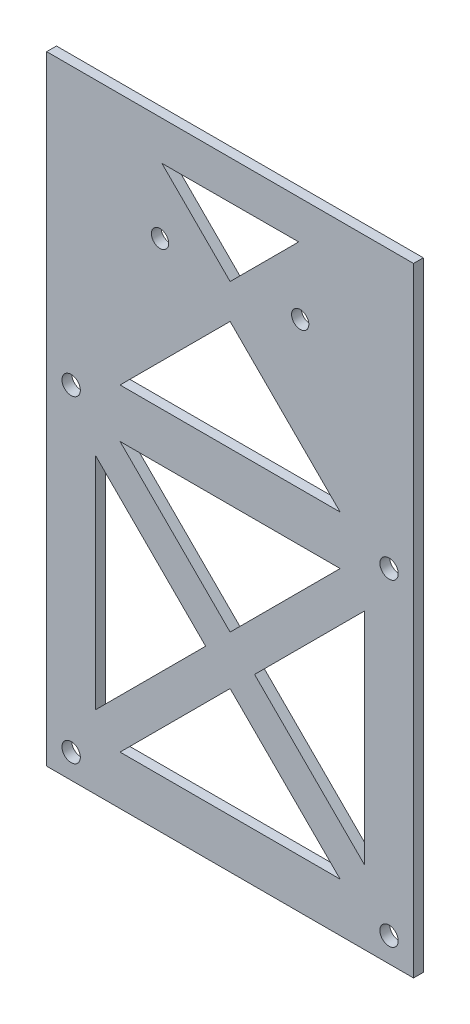
ISO-10303-21;
HEADER;
FILE_DESCRIPTION(('STEP AP214'),'2;1');
FILE_NAME('part.step','',(''),(''),'','','');
FILE_SCHEMA(('AUTOMOTIVE_DESIGN { 1 0 10303 214 1 1 1 1 }'));
ENDSEC;
DATA;
#1=APPLICATION_CONTEXT('core data for automotive mechanical design processes');
#2=APPLICATION_PROTOCOL_DEFINITION('international standard','automotive_design',2000,#1);
#3=PRODUCT_CONTEXT('',#1,'mechanical');
#4=PRODUCT('Part','Part','',(#3));
#5=PRODUCT_RELATED_PRODUCT_CATEGORY('part','',(#4));
#6=PRODUCT_DEFINITION_FORMATION('','',#4);
#7=PRODUCT_DEFINITION_CONTEXT('part definition',#1,'design');
#8=PRODUCT_DEFINITION('design','',#6,#7);
#9=PRODUCT_DEFINITION_SHAPE('','',#8);
#10=(LENGTH_UNIT() NAMED_UNIT(*) SI_UNIT(.MILLI.,.METRE.));
#11=(NAMED_UNIT(*) PLANE_ANGLE_UNIT() SI_UNIT($,.RADIAN.));
#12=(NAMED_UNIT(*) SI_UNIT($,.STERADIAN.) SOLID_ANGLE_UNIT());
#13=UNCERTAINTY_MEASURE_WITH_UNIT(LENGTH_MEASURE(1.E-05),#10,'distance_accuracy_value','');
#14=(GEOMETRIC_REPRESENTATION_CONTEXT(3) GLOBAL_UNCERTAINTY_ASSIGNED_CONTEXT((#13)) GLOBAL_UNIT_ASSIGNED_CONTEXT((#10,
#11,#12)) REPRESENTATION_CONTEXT('',''));
#15=CARTESIAN_POINT('',(0.,0.,0.));
#16=DIRECTION('',(0.,0.,1.));
#17=DIRECTION('',(1.,0.,0.));
#18=AXIS2_PLACEMENT_3D('',#15,#16,#17);
#19=CARTESIAN_POINT('',(0.,0.,2.));
#20=DIRECTION('',(0.,0.,-1.));
#21=DIRECTION('',(-1.,0.,0.));
#22=AXIS2_PLACEMENT_3D('',#19,#20,#21);
#23=PLANE('',#22);
#24=DIRECTION('',(-0.707106781186547,-0.707106781186548,0.));
#25=VECTOR('',#24,1.);
#26=CARTESIAN_POINT('',(3.76378278876638E-13,-232.048366883126,2.));
#27=LINE('',#26,#25);
#28=CARTESIAN_POINT('',(3.76378278876638E-13,-232.048366883126,2.));
#29=VERTEX_POINT('',#28);
#30=CARTESIAN_POINT('',(-22.4999999999999,-254.548366883126,2.));
#31=VERTEX_POINT('',#30);
#32=EDGE_CURVE('E749',#29,#31,#27,.T.);
#33=ORIENTED_EDGE('',*,*,#32,.F.);
#34=DIRECTION('',(-0.707106781186556,0.707106781186539,0.));
#35=VECTOR('',#34,1.);
#36=CARTESIAN_POINT('',(3.76378278876638E-13,-232.048366883126,2.));
#37=LINE('',#36,#35);
#38=CARTESIAN_POINT('',(22.5000000000012,-254.548366883126,2.));
#39=VERTEX_POINT('',#38);
#40=EDGE_CURVE('E757',#39,#29,#37,.T.);
#41=ORIENTED_EDGE('',*,*,#40,.F.);
#42=DIRECTION('',(1.,0.,0.));
#43=VECTOR('',#42,1.);
#44=CARTESIAN_POINT('',(-22.4999999999999,-254.548366883126,2.));
#45=LINE('',#44,#43);
#46=EDGE_CURVE('E752',#31,#39,#45,.T.);
#47=ORIENTED_EDGE('',*,*,#46,.F.);
#48=EDGE_LOOP('',(#33,#41,#47));
#49=FACE_BOUND('',#48,.T.);
#50=CARTESIAN_POINT('',(-32.4999999999997,-194.548366883126,2.));
#51=DIRECTION('',(0.,0.,1.));
#52=DIRECTION('',(1.,0.,0.));
#53=AXIS2_PLACEMENT_3D('',#50,#51,#52);
#54=CIRCLE('',#53,1.87499999999998);
#55=CARTESIAN_POINT('',(-30.6249999999998,-194.548366883126,2.));
#56=VERTEX_POINT('',#55);
#57=EDGE_CURVE('E232',#56,#56,#54,.T.);
#58=ORIENTED_EDGE('',*,*,#57,.F.);
#59=EDGE_LOOP('',(#58));
#60=FACE_BOUND('',#59,.T.);
#61=DIRECTION('',(-0.999997214116541,-0.00236045740423836,0.));
#62=VECTOR('',#61,1.);
#63=CARTESIAN_POINT('',(-13.9582791202752,-146.020087762851,2.));
#64=LINE('',#63,#62);
#65=CARTESIAN_POINT('',(14.0243310636869,-145.954035819439,2.));
#66=VERTEX_POINT('',#65);
#67=CARTESIAN_POINT('',(-13.9582791202752,-146.020087762851,2.));
#68=VERTEX_POINT('',#67);
#69=EDGE_CURVE('E247',#66,#68,#64,.T.);
#70=ORIENTED_EDGE('',*,*,#69,.F.);
#71=DIRECTION('',(0.707106781186545,0.70710678118655,0.));
#72=VECTOR('',#71,1.);
#73=CARTESIAN_POINT('',(14.0243310636869,-145.954035819439,2.));
#74=LINE('',#73,#72);
#75=CARTESIAN_POINT('',(0.,-159.978366883126,2.));
#76=VERTEX_POINT('',#75);
#77=EDGE_CURVE('E257',#76,#66,#74,.T.);
#78=ORIENTED_EDGE('',*,*,#77,.F.);
#79=DIRECTION('',(0.707106781186547,-0.707106781186547,0.));
#80=VECTOR('',#79,1.);
#81=CARTESIAN_POINT('',(0.,-159.978366883126,2.));
#82=LINE('',#81,#80);
#83=EDGE_CURVE('E252',#68,#76,#82,.T.);
#84=ORIENTED_EDGE('',*,*,#83,.F.);
#85=EDGE_LOOP('',(#70,#78,#84));
#86=FACE_BOUND('',#85,.T.);
#87=DIRECTION('',(0.707106781186547,0.707106781186548,0.));
#88=VECTOR('',#87,1.);
#89=CARTESIAN_POINT('',(3.25643952203386E-13,-222.048366883126,2.));
#90=LINE('',#89,#88);
#91=CARTESIAN_POINT('',(3.25643952203386E-13,-222.048366883126,2.));
#92=VERTEX_POINT('',#91);
#93=CARTESIAN_POINT('',(22.5,-199.548366883126,2.));
#94=VERTEX_POINT('',#93);
#95=EDGE_CURVE('E265',#92,#94,#90,.T.);
#96=ORIENTED_EDGE('',*,*,#95,.F.);
#97=DIRECTION('',(0.707106781186556,-0.707106781186539,0.));
#98=VECTOR('',#97,1.);
#99=CARTESIAN_POINT('',(-22.4999999999999,-199.548366883126,2.));
#100=LINE('',#99,#98);
#101=CARTESIAN_POINT('',(-22.4999999999999,-199.548366883126,2.));
#102=VERTEX_POINT('',#101);
#103=EDGE_CURVE('E277',#102,#92,#100,.T.);
#104=ORIENTED_EDGE('',*,*,#103,.F.);
#105=DIRECTION('',(-1.,0.,0.));
#106=VECTOR('',#105,1.);
#107=CARTESIAN_POINT('',(-22.4999999999999,-199.548366883126,2.));
#108=LINE('',#107,#106);
#109=EDGE_CURVE('E270',#94,#102,#108,.T.);
#110=ORIENTED_EDGE('',*,*,#109,.F.);
#111=EDGE_LOOP('',(#96,#104,#110));
#112=FACE_BOUND('',#111,.T.);
#113=CARTESIAN_POINT('',(14.3295057189679,-159.529421113488,2.));
#114=DIRECTION('',(0.,0.,1.));
#115=DIRECTION('',(1.,0.,0.));
#116=AXIS2_PLACEMENT_3D('',#113,#114,#115);
#117=CIRCLE('',#116,1.765);
#118=CARTESIAN_POINT('',(16.0945057189679,-159.529421113488,2.));
#119=VERTEX_POINT('',#118);
#120=EDGE_CURVE('E285',#119,#119,#117,.T.);
#121=ORIENTED_EDGE('',*,*,#120,.F.);
#122=EDGE_LOOP('',(#121));
#123=FACE_BOUND('',#122,.T.);
#124=CARTESIAN_POINT('',(-14.3295057189679,-159.529421113488,2.));
#125=DIRECTION('',(0.,0.,1.));
#126=DIRECTION('',(-1.,0.,0.));
#127=AXIS2_PLACEMENT_3D('',#124,#125,#126);
#128=CIRCLE('',#127,1.765);
#129=CARTESIAN_POINT('',(-16.0945057189679,-159.529421113488,2.));
#130=VERTEX_POINT('',#129);
#131=EDGE_CURVE('E505',#130,#130,#128,.T.);
#132=ORIENTED_EDGE('',*,*,#131,.F.);
#133=EDGE_LOOP('',(#132));
#134=FACE_BOUND('',#133,.T.);
#135=DIRECTION('',(0.,-1.,0.));
#136=VECTOR('',#135,1.);
#137=CARTESIAN_POINT('',(-37.4999999999999,-264.548366883126,2.));
#138=LINE('',#137,#136);
#139=CARTESIAN_POINT('',(-37.4999999999999,-138.029421113488,2.));
#140=VERTEX_POINT('',#139);
#141=CARTESIAN_POINT('',(-37.4999999999999,-264.548366883126,2.));
#142=VERTEX_POINT('',#141);
#143=EDGE_CURVE('E485',#140,#142,#138,.T.);
#144=ORIENTED_EDGE('',*,*,#143,.T.);
#145=DIRECTION('',(1.,0.,0.));
#146=VECTOR('',#145,1.);
#147=CARTESIAN_POINT('',(-37.4999999999999,-264.548366883126,2.));
#148=LINE('',#147,#146);
#149=CARTESIAN_POINT('',(37.5,-264.548366883126,2.));
#150=VERTEX_POINT('',#149);
#151=EDGE_CURVE('E500',#142,#150,#148,.T.);
#152=ORIENTED_EDGE('',*,*,#151,.T.);
#153=DIRECTION('',(0.,1.,0.));
#154=VECTOR('',#153,1.);
#155=CARTESIAN_POINT('',(37.5,-264.548366883126,2.));
#156=LINE('',#155,#154);
#157=CARTESIAN_POINT('',(37.5,-138.029421113488,2.));
#158=VERTEX_POINT('',#157);
#159=EDGE_CURVE('E479',#150,#158,#156,.T.);
#160=ORIENTED_EDGE('',*,*,#159,.T.);
#161=DIRECTION('',(-1.,0.,0.));
#162=VECTOR('',#161,1.);
#163=CARTESIAN_POINT('',(-37.4999999999999,-138.029421113488,2.));
#164=LINE('',#163,#162);
#165=EDGE_CURVE('E492',#158,#140,#164,.T.);
#166=ORIENTED_EDGE('',*,*,#165,.T.);
#167=EDGE_LOOP('',(#144,#152,#160,#166));
#168=FACE_BOUND('',#167,.T.);
#169=CARTESIAN_POINT('',(32.5,-259.548366883126,2.));
#170=DIRECTION('',(0.,0.,1.));
#171=DIRECTION('',(1.,0.,0.));
#172=AXIS2_PLACEMENT_3D('',#169,#170,#171);
#173=CIRCLE('',#172,1.87499999999998);
#174=CARTESIAN_POINT('',(34.375,-259.548366883126,2.));
#175=VERTEX_POINT('',#174);
#176=EDGE_CURVE('E297',#175,#175,#173,.T.);
#177=ORIENTED_EDGE('',*,*,#176,.F.);
#178=EDGE_LOOP('',(#177));
#179=FACE_BOUND('',#178,.T.);
#180=DIRECTION('',(0.707106781186547,0.707106781186548,0.));
#181=VECTOR('',#180,1.);
#182=CARTESIAN_POINT('',(-27.4999999999999,-249.548366883126,2.));
#183=LINE('',#182,#181);
#184=CARTESIAN_POINT('',(-27.4999999999999,-249.548366883126,2.));
#185=VERTEX_POINT('',#184);
#186=CARTESIAN_POINT('',(-4.99999999999968,-227.048366883126,2.));
#187=VERTEX_POINT('',#186);
#188=EDGE_CURVE('E312',#185,#187,#183,.T.);
#189=ORIENTED_EDGE('',*,*,#188,.F.);
#190=DIRECTION('',(0.,-1.,0.));
#191=VECTOR('',#190,1.);
#192=CARTESIAN_POINT('',(-27.4999999999999,-204.548366883126,2.));
#193=LINE('',#192,#191);
#194=CARTESIAN_POINT('',(-27.4999999999999,-204.548366883126,2.));
#195=VERTEX_POINT('',#194);
#196=EDGE_CURVE('E324',#195,#185,#193,.T.);
#197=ORIENTED_EDGE('',*,*,#196,.F.);
#198=DIRECTION('',(-0.707106781186556,0.707106781186539,0.));
#199=VECTOR('',#198,1.);
#200=CARTESIAN_POINT('',(-27.4999999999999,-204.548366883126,2.));
#201=LINE('',#200,#199);
#202=EDGE_CURVE('E317',#187,#195,#201,.T.);
#203=ORIENTED_EDGE('',*,*,#202,.F.);
#204=EDGE_LOOP('',(#189,#197,#203));
#205=FACE_BOUND('',#204,.T.);
#206=DIRECTION('',(-0.707106781186547,-0.707106781186548,0.));
#207=VECTOR('',#206,1.);
#208=CARTESIAN_POINT('',(27.5,-204.548366883126,2.));
#209=LINE('',#208,#207);
#210=CARTESIAN_POINT('',(27.5,-204.548366883126,2.));
#211=VERTEX_POINT('',#210);
#212=CARTESIAN_POINT('',(5.00000000000038,-227.048366883126,2.));
#213=VERTEX_POINT('',#212);
#214=EDGE_CURVE('E331',#211,#213,#209,.T.);
#215=ORIENTED_EDGE('',*,*,#214,.F.);
#216=DIRECTION('',(0.,1.,0.));
#217=VECTOR('',#216,1.);
#218=CARTESIAN_POINT('',(27.5,-249.548366883125,2.));
#219=LINE('',#218,#217);
#220=CARTESIAN_POINT('',(27.5,-249.548366883125,2.));
#221=VERTEX_POINT('',#220);
#222=EDGE_CURVE('E343',#221,#211,#219,.T.);
#223=ORIENTED_EDGE('',*,*,#222,.F.);
#224=DIRECTION('',(0.707106781186556,-0.707106781186539,0.));
#225=VECTOR('',#224,1.);
#226=CARTESIAN_POINT('',(5.00000000000038,-227.048366883126,2.));
#227=LINE('',#226,#225);
#228=EDGE_CURVE('E336',#213,#221,#227,.T.);
#229=ORIENTED_EDGE('',*,*,#228,.F.);
#230=EDGE_LOOP('',(#215,#223,#229));
#231=FACE_BOUND('',#230,.T.);
#232=CARTESIAN_POINT('',(-32.5000000000001,-259.548366883126,2.));
#233=DIRECTION('',(0.,0.,1.));
#234=DIRECTION('',(1.,0.,0.));
#235=AXIS2_PLACEMENT_3D('',#232,#233,#234);
#236=CIRCLE('',#235,1.87499999999998);
#237=CARTESIAN_POINT('',(-30.6250000000001,-259.548366883126,2.));
#238=VERTEX_POINT('',#237);
#239=EDGE_CURVE('E408',#238,#238,#236,.T.);
#240=ORIENTED_EDGE('',*,*,#239,.F.);
#241=EDGE_LOOP('',(#240));
#242=FACE_BOUND('',#241,.T.);
#243=CARTESIAN_POINT('',(32.5000000000004,-194.548366883126,2.));
#244=DIRECTION('',(0.,0.,1.));
#245=DIRECTION('',(1.,0.,0.));
#246=AXIS2_PLACEMENT_3D('',#243,#244,#245);
#247=CIRCLE('',#246,1.87499999999998);
#248=CARTESIAN_POINT('',(34.3750000000004,-194.548366883126,2.));
#249=VERTEX_POINT('',#248);
#250=EDGE_CURVE('E220',#249,#249,#247,.T.);
#251=ORIENTED_EDGE('',*,*,#250,.F.);
#252=EDGE_LOOP('',(#251));
#253=FACE_BOUND('',#252,.T.);
#254=DIRECTION('',(-0.707106781186548,-0.707106781186547,0.));
#255=VECTOR('',#254,1.);
#256=CARTESIAN_POINT('',(0.,-167.048366883126,2.));
#257=LINE('',#256,#255);
#258=CARTESIAN_POINT('',(0.,-167.048366883126,2.));
#259=VERTEX_POINT('',#258);
#260=CARTESIAN_POINT('',(-22.4999999999999,-189.548366883126,2.));
#261=VERTEX_POINT('',#260);
#262=EDGE_CURVE('E187',#259,#261,#257,.T.);
#263=ORIENTED_EDGE('',*,*,#262,.F.);
#264=DIRECTION('',(-0.707106781186549,0.707106781186546,0.));
#265=VECTOR('',#264,1.);
#266=CARTESIAN_POINT('',(0.,-167.048366883126,2.));
#267=LINE('',#266,#265);
#268=CARTESIAN_POINT('',(22.5000000000001,-189.548366883126,2.));
#269=VERTEX_POINT('',#268);
#270=EDGE_CURVE('E205',#269,#259,#267,.T.);
#271=ORIENTED_EDGE('',*,*,#270,.F.);
#272=DIRECTION('',(1.,0.,0.));
#273=VECTOR('',#272,1.);
#274=CARTESIAN_POINT('',(-22.4999999999999,-189.548366883126,2.));
#275=LINE('',#274,#273);
#276=EDGE_CURVE('E196',#261,#269,#275,.T.);
#277=ORIENTED_EDGE('',*,*,#276,.F.);
#278=EDGE_LOOP('',(#263,#271,#277));
#279=FACE_BOUND('',#278,.T.);
#280=ADVANCED_FACE('F38',(#49,#60,#86,#112,#123,#134,#168,#179,#205,#231,#242,#253,#279),#23,.F.);
#281=CARTESIAN_POINT('',(0.,0.,0.));
#282=DIRECTION('',(0.,0.,-1.));
#283=DIRECTION('',(-1.,0.,0.));
#284=AXIS2_PLACEMENT_3D('',#281,#282,#283);
#285=PLANE('',#284);
#286=DIRECTION('',(-0.707106781186556,0.707106781186539,0.));
#287=VECTOR('',#286,1.);
#288=CARTESIAN_POINT('',(3.76378278876638E-13,-232.048366883126,0.));
#289=LINE('',#288,#287);
#290=CARTESIAN_POINT('',(22.5000000000012,-254.548366883126,0.));
#291=VERTEX_POINT('',#290);
#292=CARTESIAN_POINT('',(3.88578058618805E-13,-232.048366883126,0.));
#293=VERTEX_POINT('',#292);
#294=EDGE_CURVE('E753',#291,#293,#289,.T.);
#295=ORIENTED_EDGE('',*,*,#294,.T.);
#296=DIRECTION('',(-0.707106781186547,-0.707106781186548,0.));
#297=VECTOR('',#296,1.);
#298=CARTESIAN_POINT('',(3.76378278876638E-13,-232.048366883126,0.));
#299=LINE('',#298,#297);
#300=CARTESIAN_POINT('',(-22.4999999999999,-254.548366883126,0.));
#301=VERTEX_POINT('',#300);
#302=EDGE_CURVE('E203',#293,#301,#299,.T.);
#303=ORIENTED_EDGE('',*,*,#302,.T.);
#304=DIRECTION('',(1.,0.,0.));
#305=VECTOR('',#304,1.);
#306=CARTESIAN_POINT('',(-22.4999999999999,-254.548366883126,0.));
#307=LINE('',#306,#305);
#308=EDGE_CURVE('E764',#301,#291,#307,.T.);
#309=ORIENTED_EDGE('',*,*,#308,.T.);
#310=EDGE_LOOP('',(#295,#303,#309));
#311=FACE_BOUND('',#310,.T.);
#312=CARTESIAN_POINT('',(-32.4999999999997,-194.548366883126,0.));
#313=DIRECTION('',(0.,0.,1.));
#314=DIRECTION('',(1.,0.,0.));
#315=AXIS2_PLACEMENT_3D('',#312,#313,#314);
#316=CIRCLE('',#315,1.87499999999998);
#317=CARTESIAN_POINT('',(-30.6249999999998,-194.548366883126,0.));
#318=VERTEX_POINT('',#317);
#319=EDGE_CURVE('E226',#318,#318,#316,.T.);
#320=ORIENTED_EDGE('',*,*,#319,.T.);
#321=EDGE_LOOP('',(#320));
#322=FACE_BOUND('',#321,.T.);
#323=DIRECTION('',(0.707106781186545,0.70710678118655,0.));
#324=VECTOR('',#323,1.);
#325=CARTESIAN_POINT('',(14.0243310636869,-145.954035819439,0.));
#326=LINE('',#325,#324);
#327=CARTESIAN_POINT('',(0.,-159.978366883126,0.));
#328=VERTEX_POINT('',#327);
#329=CARTESIAN_POINT('',(14.0243310636869,-145.954035819439,0.));
#330=VERTEX_POINT('',#329);
#331=EDGE_CURVE('E253',#328,#330,#326,.T.);
#332=ORIENTED_EDGE('',*,*,#331,.T.);
#333=DIRECTION('',(-0.999997214116541,-0.00236045740423836,0.));
#334=VECTOR('',#333,1.);
#335=CARTESIAN_POINT('',(-13.9582791202752,-146.020087762851,0.));
#336=LINE('',#335,#334);
#337=CARTESIAN_POINT('',(-13.9582791202752,-146.020087762851,0.));
#338=VERTEX_POINT('',#337);
#339=EDGE_CURVE('E410',#330,#338,#336,.T.);
#340=ORIENTED_EDGE('',*,*,#339,.T.);
#341=DIRECTION('',(0.707106781186547,-0.707106781186547,0.));
#342=VECTOR('',#341,1.);
#343=CARTESIAN_POINT('',(0.,-159.978366883126,0.));
#344=LINE('',#343,#342);
#345=EDGE_CURVE('E414',#338,#328,#344,.T.);
#346=ORIENTED_EDGE('',*,*,#345,.T.);
#347=EDGE_LOOP('',(#332,#340,#346));
#348=FACE_BOUND('',#347,.T.);
#349=DIRECTION('',(0.707106781186556,-0.707106781186539,0.));
#350=VECTOR('',#349,1.);
#351=CARTESIAN_POINT('',(-22.4999999999999,-199.548366883126,0.));
#352=LINE('',#351,#350);
#353=CARTESIAN_POINT('',(-22.4999999999999,-199.548366883126,0.));
#354=VERTEX_POINT('',#353);
#355=CARTESIAN_POINT('',(3.19189119579733E-13,-222.048366883126,0.));
#356=VERTEX_POINT('',#355);
#357=EDGE_CURVE('E271',#354,#356,#352,.T.);
#358=ORIENTED_EDGE('',*,*,#357,.T.);
#359=DIRECTION('',(0.707106781186547,0.707106781186548,0.));
#360=VECTOR('',#359,1.);
#361=CARTESIAN_POINT('',(3.25643952203386E-13,-222.048366883126,0.));
#362=LINE('',#361,#360);
#363=CARTESIAN_POINT('',(22.5,-199.548366883126,0.));
#364=VERTEX_POINT('',#363);
#365=EDGE_CURVE('E361',#356,#364,#362,.T.);
#366=ORIENTED_EDGE('',*,*,#365,.T.);
#367=DIRECTION('',(-1.,0.,0.));
#368=VECTOR('',#367,1.);
#369=CARTESIAN_POINT('',(-22.4999999999999,-199.548366883126,0.));
#370=LINE('',#369,#368);
#371=EDGE_CURVE('E365',#364,#354,#370,.T.);
#372=ORIENTED_EDGE('',*,*,#371,.T.);
#373=EDGE_LOOP('',(#358,#366,#372));
#374=FACE_BOUND('',#373,.T.);
#375=CARTESIAN_POINT('',(14.3295057189679,-159.529421113488,0.));
#376=DIRECTION('',(0.,0.,1.));
#377=DIRECTION('',(1.,0.,0.));
#378=AXIS2_PLACEMENT_3D('',#375,#376,#377);
#379=CIRCLE('',#378,1.765);
#380=CARTESIAN_POINT('',(16.0945057189679,-159.529421113488,0.));
#381=VERTEX_POINT('',#380);
#382=EDGE_CURVE('E292',#381,#381,#379,.T.);
#383=ORIENTED_EDGE('',*,*,#382,.T.);
#384=EDGE_LOOP('',(#383));
#385=FACE_BOUND('',#384,.T.);
#386=CARTESIAN_POINT('',(-14.3295057189679,-159.529421113488,0.));
#387=DIRECTION('',(0.,0.,1.));
#388=DIRECTION('',(-1.,0.,0.));
#389=AXIS2_PLACEMENT_3D('',#386,#387,#388);
#390=CIRCLE('',#389,1.765);
#391=CARTESIAN_POINT('',(-16.0945057189679,-159.529421113488,0.));
#392=VERTEX_POINT('',#391);
#393=EDGE_CURVE('E302',#392,#392,#390,.T.);
#394=ORIENTED_EDGE('',*,*,#393,.T.);
#395=EDGE_LOOP('',(#394));
#396=FACE_BOUND('',#395,.T.);
#397=DIRECTION('',(0.,-1.,0.));
#398=VECTOR('',#397,1.);
#399=CARTESIAN_POINT('',(-37.4999999999999,-264.548366883126,0.));
#400=LINE('',#399,#398);
#401=CARTESIAN_POINT('',(-37.4999999999999,-138.029421113488,0.));
#402=VERTEX_POINT('',#401);
#403=CARTESIAN_POINT('',(-37.4999999999999,-264.548366883126,0.));
#404=VERTEX_POINT('',#403);
#405=EDGE_CURVE('E475',#402,#404,#400,.T.);
#406=ORIENTED_EDGE('',*,*,#405,.F.);
#407=DIRECTION('',(-1.,0.,0.));
#408=VECTOR('',#407,1.);
#409=CARTESIAN_POINT('',(-37.4999999999999,-138.029421113488,0.));
#410=LINE('',#409,#408);
#411=CARTESIAN_POINT('',(37.5,-138.029421113488,0.));
#412=VERTEX_POINT('',#411);
#413=EDGE_CURVE('E483',#412,#402,#410,.T.);
#414=ORIENTED_EDGE('',*,*,#413,.F.);
#415=DIRECTION('',(0.,1.,0.));
#416=VECTOR('',#415,1.);
#417=CARTESIAN_POINT('',(37.5,-264.548366883126,0.));
#418=LINE('',#417,#416);
#419=CARTESIAN_POINT('',(37.5,-264.548366883126,0.));
#420=VERTEX_POINT('',#419);
#421=EDGE_CURVE('E474',#420,#412,#418,.T.);
#422=ORIENTED_EDGE('',*,*,#421,.F.);
#423=DIRECTION('',(1.,0.,0.));
#424=VECTOR('',#423,1.);
#425=CARTESIAN_POINT('',(-37.4999999999999,-264.548366883126,0.));
#426=LINE('',#425,#424);
#427=EDGE_CURVE('E466',#404,#420,#426,.T.);
#428=ORIENTED_EDGE('',*,*,#427,.F.);
#429=EDGE_LOOP('',(#406,#414,#422,#428));
#430=FACE_BOUND('',#429,.T.);
#431=CARTESIAN_POINT('',(32.5,-259.548366883126,0.));
#432=DIRECTION('',(0.,0.,1.));
#433=DIRECTION('',(1.,0.,0.));
#434=AXIS2_PLACEMENT_3D('',#431,#432,#433);
#435=CIRCLE('',#434,1.87499999999998);
#436=CARTESIAN_POINT('',(34.375,-259.548366883126,0.));
#437=VERTEX_POINT('',#436);
#438=EDGE_CURVE('E291',#437,#437,#435,.T.);
#439=ORIENTED_EDGE('',*,*,#438,.T.);
#440=EDGE_LOOP('',(#439));
#441=FACE_BOUND('',#440,.T.);
#442=DIRECTION('',(0.,-1.,0.));
#443=VECTOR('',#442,1.);
#444=CARTESIAN_POINT('',(-27.4999999999999,-204.548366883126,0.));
#445=LINE('',#444,#443);
#446=CARTESIAN_POINT('',(-27.4999999999999,-204.548366883126,0.));
#447=VERTEX_POINT('',#446);
#448=CARTESIAN_POINT('',(-27.4999999999999,-249.548366883126,0.));
#449=VERTEX_POINT('',#448);
#450=EDGE_CURVE('E318',#447,#449,#445,.T.);
#451=ORIENTED_EDGE('',*,*,#450,.T.);
#452=DIRECTION('',(0.707106781186547,0.707106781186548,0.));
#453=VECTOR('',#452,1.);
#454=CARTESIAN_POINT('',(-27.4999999999999,-249.548366883126,0.));
#455=LINE('',#454,#453);
#456=CARTESIAN_POINT('',(-4.99999999999968,-227.048366883126,0.));
#457=VERTEX_POINT('',#456);
#458=EDGE_CURVE('E378',#449,#457,#455,.T.);
#459=ORIENTED_EDGE('',*,*,#458,.T.);
#460=DIRECTION('',(-0.707106781186556,0.707106781186539,0.));
#461=VECTOR('',#460,1.);
#462=CARTESIAN_POINT('',(-27.4999999999999,-204.548366883126,0.));
#463=LINE('',#462,#461);
#464=EDGE_CURVE('E382',#457,#447,#463,.T.);
#465=ORIENTED_EDGE('',*,*,#464,.T.);
#466=EDGE_LOOP('',(#451,#459,#465));
#467=FACE_BOUND('',#466,.T.);
#468=DIRECTION('',(0.,1.,0.));
#469=VECTOR('',#468,1.);
#470=CARTESIAN_POINT('',(27.5,-249.548366883125,0.));
#471=LINE('',#470,#469);
#472=CARTESIAN_POINT('',(27.5,-249.548366883125,0.));
#473=VERTEX_POINT('',#472);
#474=CARTESIAN_POINT('',(27.5,-204.548366883126,0.));
#475=VERTEX_POINT('',#474);
#476=EDGE_CURVE('E337',#473,#475,#471,.T.);
#477=ORIENTED_EDGE('',*,*,#476,.T.);
#478=DIRECTION('',(-0.707106781186547,-0.707106781186548,0.));
#479=VECTOR('',#478,1.);
#480=CARTESIAN_POINT('',(27.5,-204.548366883126,0.));
#481=LINE('',#480,#479);
#482=CARTESIAN_POINT('',(5.00000000000038,-227.048366883126,0.));
#483=VERTEX_POINT('',#482);
#484=EDGE_CURVE('E348',#475,#483,#481,.T.);
#485=ORIENTED_EDGE('',*,*,#484,.T.);
#486=DIRECTION('',(0.707106781186556,-0.707106781186539,0.));
#487=VECTOR('',#486,1.);
#488=CARTESIAN_POINT('',(5.00000000000038,-227.048366883126,0.));
#489=LINE('',#488,#487);
#490=EDGE_CURVE('E351',#483,#473,#489,.T.);
#491=ORIENTED_EDGE('',*,*,#490,.T.);
#492=EDGE_LOOP('',(#477,#485,#491));
#493=FACE_BOUND('',#492,.T.);
#494=CARTESIAN_POINT('',(-32.5000000000001,-259.548366883126,0.));
#495=DIRECTION('',(0.,0.,1.));
#496=DIRECTION('',(1.,0.,0.));
#497=AXIS2_PLACEMENT_3D('',#494,#495,#496);
#498=CIRCLE('',#497,1.87499999999998);
#499=CARTESIAN_POINT('',(-30.6250000000001,-259.548366883126,0.));
#500=VERTEX_POINT('',#499);
#501=EDGE_CURVE('E237',#500,#500,#498,.T.);
#502=ORIENTED_EDGE('',*,*,#501,.T.);
#503=EDGE_LOOP('',(#502));
#504=FACE_BOUND('',#503,.T.);
#505=CARTESIAN_POINT('',(32.5000000000004,-194.548366883126,0.));
#506=DIRECTION('',(0.,0.,1.));
#507=DIRECTION('',(1.,0.,0.));
#508=AXIS2_PLACEMENT_3D('',#505,#506,#507);
#509=CIRCLE('',#508,1.87499999999998);
#510=CARTESIAN_POINT('',(34.3750000000004,-194.548366883126,0.));
#511=VERTEX_POINT('',#510);
#512=EDGE_CURVE('E227',#511,#511,#509,.T.);
#513=ORIENTED_EDGE('',*,*,#512,.T.);
#514=EDGE_LOOP('',(#513));
#515=FACE_BOUND('',#514,.T.);
#516=DIRECTION('',(-0.707106781186549,0.707106781186546,0.));
#517=VECTOR('',#516,1.);
#518=CARTESIAN_POINT('',(0.,-167.048366883126,0.));
#519=LINE('',#518,#517);
#520=CARTESIAN_POINT('',(22.5000000000001,-189.548366883126,0.));
#521=VERTEX_POINT('',#520);
#522=CARTESIAN_POINT('',(0.,-167.048366883126,0.));
#523=VERTEX_POINT('',#522);
#524=EDGE_CURVE('E197',#521,#523,#519,.T.);
#525=ORIENTED_EDGE('',*,*,#524,.T.);
#526=DIRECTION('',(-0.707106781186548,-0.707106781186547,0.));
#527=VECTOR('',#526,1.);
#528=CARTESIAN_POINT('',(0.,-167.048366883126,0.));
#529=LINE('',#528,#527);
#530=CARTESIAN_POINT('',(-22.4999999999999,-189.548366883126,0.));
#531=VERTEX_POINT('',#530);
#532=EDGE_CURVE('E61',#523,#531,#529,.T.);
#533=ORIENTED_EDGE('',*,*,#532,.T.);
#534=DIRECTION('',(1.,0.,0.));
#535=VECTOR('',#534,1.);
#536=CARTESIAN_POINT('',(-22.4999999999999,-189.548366883126,0.));
#537=LINE('',#536,#535);
#538=EDGE_CURVE('E202',#531,#521,#537,.T.);
#539=ORIENTED_EDGE('',*,*,#538,.T.);
#540=EDGE_LOOP('',(#525,#533,#539));
#541=FACE_BOUND('',#540,.T.);
#542=ADVANCED_FACE('F419',(#311,#322,#348,#374,#385,#396,#430,#441,#467,#493,#504,#515,#541),
#285,.T.);
#543=CARTESIAN_POINT('',(-37.4999999999999,-264.548366883126,2.));
#544=DIRECTION('',(1.,0.,0.));
#545=DIRECTION('',(0.,0.,-1.));
#546=AXIS2_PLACEMENT_3D('',#543,#544,#545);
#547=PLANE('',#546);
#548=ORIENTED_EDGE('',*,*,#405,.T.);
#549=DIRECTION('',(0.,0.,-1.));
#550=VECTOR('',#549,1.);
#551=CARTESIAN_POINT('',(-37.4999999999999,-264.548366883126,2.));
#552=LINE('',#551,#550);
#553=EDGE_CURVE('E12',#142,#404,#552,.T.);
#554=ORIENTED_EDGE('',*,*,#553,.F.);
#555=ORIENTED_EDGE('',*,*,#143,.F.);
#556=DIRECTION('',(0.,0.,-1.));
#557=VECTOR('',#556,1.);
#558=CARTESIAN_POINT('',(-37.4999999999999,-138.029421113488,2.));
#559=LINE('',#558,#557);
#560=EDGE_CURVE('E489',#140,#402,#559,.T.);
#561=ORIENTED_EDGE('',*,*,#560,.T.);
#562=EDGE_LOOP('',(#548,#554,#555,#561));
#563=FACE_BOUND('',#562,.T.);
#564=ADVANCED_FACE('F40',(#563),#547,.F.);
#565=CARTESIAN_POINT('',(-37.4999999999999,-264.548366883126,2.));
#566=DIRECTION('',(0.,1.,0.));
#567=DIRECTION('',(-1.,0.,0.));
#568=AXIS2_PLACEMENT_3D('',#565,#566,#567);
#569=PLANE('',#568);
#570=ORIENTED_EDGE('',*,*,#427,.T.);
#571=DIRECTION('',(0.,0.,-1.));
#572=VECTOR('',#571,1.);
#573=CARTESIAN_POINT('',(37.5,-264.548366883126,2.));
#574=LINE('',#573,#572);
#575=EDGE_CURVE('E46',#150,#420,#574,.T.);
#576=ORIENTED_EDGE('',*,*,#575,.F.);
#577=ORIENTED_EDGE('',*,*,#151,.F.);
#578=ORIENTED_EDGE('',*,*,#553,.T.);
#579=EDGE_LOOP('',(#570,#576,#577,#578));
#580=FACE_BOUND('',#579,.T.);
#581=ADVANCED_FACE('F457',(#580),#569,.F.);
#582=CARTESIAN_POINT('',(37.5,-264.548366883126,2.));
#583=DIRECTION('',(-1.,0.,0.));
#584=DIRECTION('',(0.,-1.,0.));
#585=AXIS2_PLACEMENT_3D('',#582,#583,#584);
#586=PLANE('',#585);
#587=ORIENTED_EDGE('',*,*,#421,.T.);
#588=DIRECTION('',(0.,0.,-1.));
#589=VECTOR('',#588,1.);
#590=CARTESIAN_POINT('',(37.5,-138.029421113488,2.));
#591=LINE('',#590,#589);
#592=EDGE_CURVE('E480',#158,#412,#591,.T.);
#593=ORIENTED_EDGE('',*,*,#592,.F.);
#594=ORIENTED_EDGE('',*,*,#159,.F.);
#595=ORIENTED_EDGE('',*,*,#575,.T.);
#596=EDGE_LOOP('',(#587,#593,#594,#595));
#597=FACE_BOUND('',#596,.T.);
#598=ADVANCED_FACE('F454',(#597),#586,.F.);
#599=CARTESIAN_POINT('',(-37.4999999999999,-138.029421113488,2.));
#600=DIRECTION('',(0.,-1.,0.));
#601=DIRECTION('',(0.,0.,-1.));
#602=AXIS2_PLACEMENT_3D('',#599,#600,#601);
#603=PLANE('',#602);
#604=ORIENTED_EDGE('',*,*,#413,.T.);
#605=ORIENTED_EDGE('',*,*,#560,.F.);
#606=ORIENTED_EDGE('',*,*,#165,.F.);
#607=ORIENTED_EDGE('',*,*,#592,.T.);
#608=EDGE_LOOP('',(#604,#605,#606,#607));
#609=FACE_BOUND('',#608,.T.);
#610=ADVANCED_FACE('F451',(#609),#603,.F.);
#611=CARTESIAN_POINT('',(-14.3295057189679,-159.529421113488,2.));
#612=DIRECTION('',(0.,0.,-1.));
#613=DIRECTION('',(-1.,0.,0.));
#614=AXIS2_PLACEMENT_3D('',#611,#612,#613);
#615=CYLINDRICAL_SURFACE('',#614,1.765);
#616=ORIENTED_EDGE('',*,*,#131,.T.);
#617=EDGE_LOOP('',(#616));
#618=FACE_BOUND('',#617,.T.);
#619=ORIENTED_EDGE('',*,*,#393,.F.);
#620=EDGE_LOOP('',(#619));
#621=FACE_BOUND('',#620,.T.);
#622=ADVANCED_FACE('F448',(#618,#621),#615,.F.);
#623=CARTESIAN_POINT('',(32.5,-259.548366883126,2.));
#624=DIRECTION('',(0.,0.,-1.));
#625=DIRECTION('',(-1.,0.,0.));
#626=AXIS2_PLACEMENT_3D('',#623,#624,#625);
#627=CYLINDRICAL_SURFACE('',#626,1.87499999999998);
#628=ORIENTED_EDGE('',*,*,#176,.T.);
#629=EDGE_LOOP('',(#628));
#630=FACE_BOUND('',#629,.T.);
#631=ORIENTED_EDGE('',*,*,#438,.F.);
#632=EDGE_LOOP('',(#631));
#633=FACE_BOUND('',#632,.T.);
#634=ADVANCED_FACE('F522',(#630,#633),#627,.F.);
#635=CARTESIAN_POINT('',(14.3295057189679,-159.529421113488,2.));
#636=DIRECTION('',(0.,0.,-1.));
#637=DIRECTION('',(-1.,0.,0.));
#638=AXIS2_PLACEMENT_3D('',#635,#636,#637);
#639=CYLINDRICAL_SURFACE('',#638,1.765);
#640=ORIENTED_EDGE('',*,*,#120,.T.);
#641=EDGE_LOOP('',(#640));
#642=FACE_BOUND('',#641,.T.);
#643=ORIENTED_EDGE('',*,*,#382,.F.);
#644=EDGE_LOOP('',(#643));
#645=FACE_BOUND('',#644,.T.);
#646=ADVANCED_FACE('F525',(#642,#645),#639,.F.);
#647=CARTESIAN_POINT('',(-27.4999999999999,-249.548366883126,2.));
#648=DIRECTION('',(-0.707106781186548,0.707106781186547,0.));
#649=DIRECTION('',(-0.707106781186547,-0.707106781186548,0.));
#650=AXIS2_PLACEMENT_3D('',#647,#648,#649);
#651=PLANE('',#650);
#652=ORIENTED_EDGE('',*,*,#458,.F.);
#653=DIRECTION('',(0.,0.,-1.));
#654=VECTOR('',#653,1.);
#655=CARTESIAN_POINT('',(-27.4999999999999,-249.548366883126,2.));
#656=LINE('',#655,#654);
#657=EDGE_CURVE('E389',#185,#449,#656,.T.);
#658=ORIENTED_EDGE('',*,*,#657,.F.);
#659=ORIENTED_EDGE('',*,*,#188,.T.);
#660=DIRECTION('',(0.,0.,-1.));
#661=VECTOR('',#660,1.);
#662=CARTESIAN_POINT('',(-4.99999999999968,-227.048366883126,2.));
#663=LINE('',#662,#661);
#664=EDGE_CURVE('E293',#187,#457,#663,.T.);
#665=ORIENTED_EDGE('',*,*,#664,.T.);
#666=EDGE_LOOP('',(#652,#658,#659,#665));
#667=FACE_BOUND('',#666,.T.);
#668=ADVANCED_FACE('F397',(#667),#651,.T.);
#669=CARTESIAN_POINT('',(-27.4999999999999,-204.548366883126,2.));
#670=DIRECTION('',(-0.707106781186539,-0.707106781186556,0.));
#671=DIRECTION('',(0.707106781186556,-0.707106781186539,0.));
#672=AXIS2_PLACEMENT_3D('',#669,#670,#671);
#673=PLANE('',#672);
#674=ORIENTED_EDGE('',*,*,#464,.F.);
#675=ORIENTED_EDGE('',*,*,#664,.F.);
#676=ORIENTED_EDGE('',*,*,#202,.T.);
#677=DIRECTION('',(0.,0.,-1.));
#678=VECTOR('',#677,1.);
#679=CARTESIAN_POINT('',(-27.4999999999999,-204.548366883126,2.));
#680=LINE('',#679,#678);
#681=EDGE_CURVE('E391',#195,#447,#680,.T.);
#682=ORIENTED_EDGE('',*,*,#681,.T.);
#683=EDGE_LOOP('',(#674,#675,#676,#682));
#684=FACE_BOUND('',#683,.T.);
#685=ADVANCED_FACE('F401',(#684),#673,.T.);
#686=CARTESIAN_POINT('',(-27.4999999999999,-204.548366883126,2.));
#687=DIRECTION('',(1.,0.,0.));
#688=DIRECTION('',(0.,1.,0.));
#689=AXIS2_PLACEMENT_3D('',#686,#687,#688);
#690=PLANE('',#689);
#691=ORIENTED_EDGE('',*,*,#450,.F.);
#692=ORIENTED_EDGE('',*,*,#681,.F.);
#693=ORIENTED_EDGE('',*,*,#196,.T.);
#694=ORIENTED_EDGE('',*,*,#657,.T.);
#695=EDGE_LOOP('',(#691,#692,#693,#694));
#696=FACE_BOUND('',#695,.T.);
#697=ADVANCED_FACE('F559',(#696),#690,.T.);
#698=CARTESIAN_POINT('',(3.25643952203386E-13,-222.048366883126,2.));
#699=DIRECTION('',(-0.707106781186548,0.707106781186547,0.));
#700=DIRECTION('',(-0.707106781186547,-0.707106781186548,0.));
#701=AXIS2_PLACEMENT_3D('',#698,#699,#700);
#702=PLANE('',#701);
#703=ORIENTED_EDGE('',*,*,#365,.F.);
#704=DIRECTION('',(0.,0.,-1.));
#705=VECTOR('',#704,1.);
#706=CARTESIAN_POINT('',(3.25643952203386E-13,-222.048366883126,2.));
#707=LINE('',#706,#705);
#708=EDGE_CURVE('E372',#92,#356,#707,.T.);
#709=ORIENTED_EDGE('',*,*,#708,.F.);
#710=ORIENTED_EDGE('',*,*,#95,.T.);
#711=DIRECTION('',(0.,0.,-1.));
#712=VECTOR('',#711,1.);
#713=CARTESIAN_POINT('',(22.5,-199.548366883126,2.));
#714=LINE('',#713,#712);
#715=EDGE_CURVE('E319',#94,#364,#714,.T.);
#716=ORIENTED_EDGE('',*,*,#715,.T.);
#717=EDGE_LOOP('',(#703,#709,#710,#716));
#718=FACE_BOUND('',#717,.T.);
#719=ADVANCED_FACE('F556',(#718),#702,.T.);
#720=CARTESIAN_POINT('',(-22.4999999999999,-199.548366883126,2.));
#721=DIRECTION('',(0.,-1.,0.));
#722=DIRECTION('',(0.,0.,-1.));
#723=AXIS2_PLACEMENT_3D('',#720,#721,#722);
#724=PLANE('',#723);
#725=ORIENTED_EDGE('',*,*,#371,.F.);
#726=ORIENTED_EDGE('',*,*,#715,.F.);
#727=ORIENTED_EDGE('',*,*,#109,.T.);
#728=DIRECTION('',(0.,0.,-1.));
#729=VECTOR('',#728,1.);
#730=CARTESIAN_POINT('',(-22.4999999999999,-199.548366883126,2.));
#731=LINE('',#730,#729);
#732=EDGE_CURVE('E374',#102,#354,#731,.T.);
#733=ORIENTED_EDGE('',*,*,#732,.T.);
#734=EDGE_LOOP('',(#725,#726,#727,#733));
#735=FACE_BOUND('',#734,.T.);
#736=ADVANCED_FACE('F552',(#735),#724,.T.);
#737=CARTESIAN_POINT('',(-22.4999999999999,-199.548366883126,2.));
#738=DIRECTION('',(0.707106781186539,0.707106781186556,0.));
#739=DIRECTION('',(-0.707106781186556,0.707106781186539,0.));
#740=AXIS2_PLACEMENT_3D('',#737,#738,#739);
#741=PLANE('',#740);
#742=ORIENTED_EDGE('',*,*,#357,.F.);
#743=ORIENTED_EDGE('',*,*,#732,.F.);
#744=ORIENTED_EDGE('',*,*,#103,.T.);
#745=ORIENTED_EDGE('',*,*,#708,.T.);
#746=EDGE_LOOP('',(#742,#743,#744,#745));
#747=FACE_BOUND('',#746,.T.);
#748=ADVANCED_FACE('F546',(#747),#741,.T.);
#749=CARTESIAN_POINT('',(27.5,-204.548366883126,2.));
#750=DIRECTION('',(0.707106781186548,-0.707106781186547,0.));
#751=DIRECTION('',(0.707106781186547,0.707106781186548,0.));
#752=AXIS2_PLACEMENT_3D('',#749,#750,#751);
#753=PLANE('',#752);
#754=ORIENTED_EDGE('',*,*,#484,.F.);
#755=DIRECTION('',(0.,0.,-1.));
#756=VECTOR('',#755,1.);
#757=CARTESIAN_POINT('',(27.5,-204.548366883126,2.));
#758=LINE('',#757,#756);
#759=EDGE_CURVE('E347',#211,#475,#758,.T.);
#760=ORIENTED_EDGE('',*,*,#759,.F.);
#761=ORIENTED_EDGE('',*,*,#214,.T.);
#762=DIRECTION('',(0.,0.,-1.));
#763=VECTOR('',#762,1.);
#764=CARTESIAN_POINT('',(5.00000000000038,-227.048366883126,2.));
#765=LINE('',#764,#763);
#766=EDGE_CURVE('E272',#213,#483,#765,.T.);
#767=ORIENTED_EDGE('',*,*,#766,.T.);
#768=EDGE_LOOP('',(#754,#760,#761,#767));
#769=FACE_BOUND('',#768,.T.);
#770=ADVANCED_FACE('F534',(#769),#753,.T.);
#771=CARTESIAN_POINT('',(5.00000000000038,-227.048366883126,2.));
#772=DIRECTION('',(0.707106781186539,0.707106781186556,0.));
#773=DIRECTION('',(-0.707106781186556,0.707106781186539,0.));
#774=AXIS2_PLACEMENT_3D('',#771,#772,#773);
#775=PLANE('',#774);
#776=ORIENTED_EDGE('',*,*,#490,.F.);
#777=ORIENTED_EDGE('',*,*,#766,.F.);
#778=ORIENTED_EDGE('',*,*,#228,.T.);
#779=DIRECTION('',(0.,0.,-1.));
#780=VECTOR('',#779,1.);
#781=CARTESIAN_POINT('',(27.5,-249.548366883125,2.));
#782=LINE('',#781,#780);
#783=EDGE_CURVE('E357',#221,#473,#782,.T.);
#784=ORIENTED_EDGE('',*,*,#783,.T.);
#785=EDGE_LOOP('',(#776,#777,#778,#784));
#786=FACE_BOUND('',#785,.T.);
#787=ADVANCED_FACE('F537',(#786),#775,.T.);
#788=CARTESIAN_POINT('',(27.5,-249.548366883125,2.));
#789=DIRECTION('',(-1.,0.,0.));
#790=DIRECTION('',(0.,0.,1.));
#791=AXIS2_PLACEMENT_3D('',#788,#789,#790);
#792=PLANE('',#791);
#793=ORIENTED_EDGE('',*,*,#476,.F.);
#794=ORIENTED_EDGE('',*,*,#783,.F.);
#795=ORIENTED_EDGE('',*,*,#222,.T.);
#796=ORIENTED_EDGE('',*,*,#759,.T.);
#797=EDGE_LOOP('',(#793,#794,#795,#796));
#798=FACE_BOUND('',#797,.T.);
#799=ADVANCED_FACE('F530',(#798),#792,.T.);
#800=CARTESIAN_POINT('',(-13.9582791202752,-146.020087762851,2.));
#801=DIRECTION('',(0.00236045740423836,-0.999997214116541,0.));
#802=DIRECTION('',(0.999997214116541,0.00236045740423836,0.));
#803=AXIS2_PLACEMENT_3D('',#800,#801,#802);
#804=PLANE('',#803);
#805=ORIENTED_EDGE('',*,*,#339,.F.);
#806=DIRECTION('',(0.,0.,-1.));
#807=VECTOR('',#806,1.);
#808=CARTESIAN_POINT('',(14.0243310636869,-145.954035819439,2.));
#809=LINE('',#808,#807);
#810=EDGE_CURVE('E781',#66,#330,#809,.T.);
#811=ORIENTED_EDGE('',*,*,#810,.F.);
#812=ORIENTED_EDGE('',*,*,#69,.T.);
#813=DIRECTION('',(0.,0.,-1.));
#814=VECTOR('',#813,1.);
#815=CARTESIAN_POINT('',(-13.9582791202752,-146.020087762851,2.));
#816=LINE('',#815,#814);
#817=EDGE_CURVE('E338',#68,#338,#816,.T.);
#818=ORIENTED_EDGE('',*,*,#817,.T.);
#819=EDGE_LOOP('',(#805,#811,#812,#818));
#820=FACE_BOUND('',#819,.T.);
#821=ADVANCED_FACE('F544',(#820),#804,.T.);
#822=CARTESIAN_POINT('',(0.,-159.978366883126,2.));
#823=DIRECTION('',(0.707106781186547,0.707106781186547,0.));
#824=DIRECTION('',(-0.707106781186548,0.707106781186548,0.));
#825=AXIS2_PLACEMENT_3D('',#822,#823,#824);
#826=PLANE('',#825);
#827=ORIENTED_EDGE('',*,*,#345,.F.);
#828=ORIENTED_EDGE('',*,*,#817,.F.);
#829=ORIENTED_EDGE('',*,*,#83,.T.);
#830=DIRECTION('',(0.,0.,-1.));
#831=VECTOR('',#830,1.);
#832=CARTESIAN_POINT('',(0.,-159.978366883126,2.));
#833=LINE('',#832,#831);
#834=EDGE_CURVE('E793',#76,#328,#833,.T.);
#835=ORIENTED_EDGE('',*,*,#834,.T.);
#836=EDGE_LOOP('',(#827,#828,#829,#835));
#837=FACE_BOUND('',#836,.T.);
#838=ADVANCED_FACE('F434',(#837),#826,.T.);
#839=CARTESIAN_POINT('',(14.0243310636869,-145.954035819439,2.));
#840=DIRECTION('',(-0.70710678118655,0.707106781186545,0.));
#841=DIRECTION('',(-0.707106781186545,-0.70710678118655,0.));
#842=AXIS2_PLACEMENT_3D('',#839,#840,#841);
#843=PLANE('',#842);
#844=ORIENTED_EDGE('',*,*,#331,.F.);
#845=ORIENTED_EDGE('',*,*,#834,.F.);
#846=ORIENTED_EDGE('',*,*,#77,.T.);
#847=ORIENTED_EDGE('',*,*,#810,.T.);
#848=EDGE_LOOP('',(#844,#845,#846,#847));
#849=FACE_BOUND('',#848,.T.);
#850=ADVANCED_FACE('F425',(#849),#843,.T.);
#851=CARTESIAN_POINT('',(-32.5000000000001,-259.548366883126,2.));
#852=DIRECTION('',(0.,0.,-1.));
#853=DIRECTION('',(-1.,0.,0.));
#854=AXIS2_PLACEMENT_3D('',#851,#852,#853);
#855=CYLINDRICAL_SURFACE('',#854,1.87499999999998);
#856=ORIENTED_EDGE('',*,*,#239,.T.);
#857=EDGE_LOOP('',(#856));
#858=FACE_BOUND('',#857,.T.);
#859=ORIENTED_EDGE('',*,*,#501,.F.);
#860=EDGE_LOOP('',(#859));
#861=FACE_BOUND('',#860,.T.);
#862=ADVANCED_FACE('F422',(#858,#861),#855,.F.);
#863=CARTESIAN_POINT('',(-32.4999999999997,-194.548366883126,2.));
#864=DIRECTION('',(0.,0.,-1.));
#865=DIRECTION('',(-1.,0.,0.));
#866=AXIS2_PLACEMENT_3D('',#863,#864,#865);
#867=CYLINDRICAL_SURFACE('',#866,1.87499999999998);
#868=ORIENTED_EDGE('',*,*,#57,.T.);
#869=EDGE_LOOP('',(#868));
#870=FACE_BOUND('',#869,.T.);
#871=ORIENTED_EDGE('',*,*,#319,.F.);
#872=EDGE_LOOP('',(#871));
#873=FACE_BOUND('',#872,.T.);
#874=ADVANCED_FACE('F424',(#870,#873),#867,.F.);
#875=CARTESIAN_POINT('',(32.5000000000004,-194.548366883126,2.));
#876=DIRECTION('',(0.,0.,-1.));
#877=DIRECTION('',(-1.,0.,0.));
#878=AXIS2_PLACEMENT_3D('',#875,#876,#877);
#879=CYLINDRICAL_SURFACE('',#878,1.87499999999998);
#880=ORIENTED_EDGE('',*,*,#250,.T.);
#881=EDGE_LOOP('',(#880));
#882=FACE_BOUND('',#881,.T.);
#883=ORIENTED_EDGE('',*,*,#512,.F.);
#884=EDGE_LOOP('',(#883));
#885=FACE_BOUND('',#884,.T.);
#886=ADVANCED_FACE('F431',(#882,#885),#879,.F.);
#887=CARTESIAN_POINT('',(3.76378278876638E-13,-232.048366883126,2.));
#888=DIRECTION('',(0.707106781186548,-0.707106781186547,0.));
#889=DIRECTION('',(0.707106781186547,0.707106781186548,0.));
#890=AXIS2_PLACEMENT_3D('',#887,#888,#889);
#891=PLANE('',#890);
#892=ORIENTED_EDGE('',*,*,#302,.F.);
#893=DIRECTION('',(0.,0.,-1.));
#894=VECTOR('',#893,1.);
#895=CARTESIAN_POINT('',(3.76378278876638E-13,-232.048366883126,2.));
#896=LINE('',#895,#894);
#897=EDGE_CURVE('E761',#29,#293,#896,.T.);
#898=ORIENTED_EDGE('',*,*,#897,.F.);
#899=ORIENTED_EDGE('',*,*,#32,.T.);
#900=DIRECTION('',(0.,0.,-1.));
#901=VECTOR('',#900,1.);
#902=CARTESIAN_POINT('',(-22.4999999999999,-254.548366883126,2.));
#903=LINE('',#902,#901);
#904=EDGE_CURVE('E228',#31,#301,#903,.T.);
#905=ORIENTED_EDGE('',*,*,#904,.T.);
#906=EDGE_LOOP('',(#892,#898,#899,#905));
#907=FACE_BOUND('',#906,.T.);
#908=ADVANCED_FACE('F684',(#907),#891,.T.);
#909=CARTESIAN_POINT('',(-22.4999999999999,-254.548366883126,2.));
#910=DIRECTION('',(0.,1.,0.));
#911=DIRECTION('',(0.,0.,1.));
#912=AXIS2_PLACEMENT_3D('',#909,#910,#911);
#913=PLANE('',#912);
#914=ORIENTED_EDGE('',*,*,#308,.F.);
#915=ORIENTED_EDGE('',*,*,#904,.F.);
#916=ORIENTED_EDGE('',*,*,#46,.T.);
#917=DIRECTION('',(0.,0.,-1.));
#918=VECTOR('',#917,1.);
#919=CARTESIAN_POINT('',(22.5000000000012,-254.548366883126,2.));
#920=LINE('',#919,#918);
#921=EDGE_CURVE('E770',#39,#291,#920,.T.);
#922=ORIENTED_EDGE('',*,*,#921,.T.);
#923=EDGE_LOOP('',(#914,#915,#916,#922));
#924=FACE_BOUND('',#923,.T.);
#925=ADVANCED_FACE('F694',(#924),#913,.T.);
#926=CARTESIAN_POINT('',(3.76378278876638E-13,-232.048366883126,2.));
#927=DIRECTION('',(-0.707106781186539,-0.707106781186556,0.));
#928=DIRECTION('',(0.707106781186556,-0.707106781186539,0.));
#929=AXIS2_PLACEMENT_3D('',#926,#927,#928);
#930=PLANE('',#929);
#931=ORIENTED_EDGE('',*,*,#294,.F.);
#932=ORIENTED_EDGE('',*,*,#921,.F.);
#933=ORIENTED_EDGE('',*,*,#40,.T.);
#934=ORIENTED_EDGE('',*,*,#897,.T.);
#935=EDGE_LOOP('',(#931,#932,#933,#934));
#936=FACE_BOUND('',#935,.T.);
#937=ADVANCED_FACE('F704',(#936),#930,.T.);
#938=CARTESIAN_POINT('',(0.,-167.048366883126,2.));
#939=DIRECTION('',(0.707106781186547,-0.707106781186548,0.));
#940=DIRECTION('',(0.707106781186548,0.707106781186547,0.));
#941=AXIS2_PLACEMENT_3D('',#938,#939,#940);
#942=PLANE('',#941);
#943=ORIENTED_EDGE('',*,*,#532,.F.);
#944=DIRECTION('',(0.,0.,-1.));
#945=VECTOR('',#944,1.);
#946=CARTESIAN_POINT('',(0.,-167.048366883126,2.));
#947=LINE('',#946,#945);
#948=EDGE_CURVE('E191',#259,#523,#947,.T.);
#949=ORIENTED_EDGE('',*,*,#948,.F.);
#950=ORIENTED_EDGE('',*,*,#262,.T.);
#951=DIRECTION('',(0.,0.,-1.));
#952=VECTOR('',#951,1.);
#953=CARTESIAN_POINT('',(-22.4999999999999,-189.548366883126,2.));
#954=LINE('',#953,#952);
#955=EDGE_CURVE('E190',#261,#531,#954,.T.);
#956=ORIENTED_EDGE('',*,*,#955,.T.);
#957=EDGE_LOOP('',(#943,#949,#950,#956));
#958=FACE_BOUND('',#957,.T.);
#959=ADVANCED_FACE('F189',(#958),#942,.T.);
#960=CARTESIAN_POINT('',(-22.4999999999999,-189.548366883126,2.));
#961=DIRECTION('',(0.,1.,0.));
#962=DIRECTION('',(0.,0.,1.));
#963=AXIS2_PLACEMENT_3D('',#960,#961,#962);
#964=PLANE('',#963);
#965=ORIENTED_EDGE('',*,*,#538,.F.);
#966=ORIENTED_EDGE('',*,*,#955,.F.);
#967=ORIENTED_EDGE('',*,*,#276,.T.);
#968=DIRECTION('',(0.,0.,-1.));
#969=VECTOR('',#968,1.);
#970=CARTESIAN_POINT('',(22.5000000000001,-189.548366883126,2.));
#971=LINE('',#970,#969);
#972=EDGE_CURVE('E53',#269,#521,#971,.T.);
#973=ORIENTED_EDGE('',*,*,#972,.T.);
#974=EDGE_LOOP('',(#965,#966,#967,#973));
#975=FACE_BOUND('',#974,.T.);
#976=ADVANCED_FACE('F200',(#975),#964,.T.);
#977=CARTESIAN_POINT('',(0.,-167.048366883126,2.));
#978=DIRECTION('',(-0.707106781186546,-0.707106781186549,0.));
#979=DIRECTION('',(0.707106781186549,-0.707106781186546,0.));
#980=AXIS2_PLACEMENT_3D('',#977,#978,#979);
#981=PLANE('',#980);
#982=ORIENTED_EDGE('',*,*,#524,.F.);
#983=ORIENTED_EDGE('',*,*,#972,.F.);
#984=ORIENTED_EDGE('',*,*,#270,.T.);
#985=ORIENTED_EDGE('',*,*,#948,.T.);
#986=EDGE_LOOP('',(#982,#983,#984,#985));
#987=FACE_BOUND('',#986,.T.);
#988=ADVANCED_FACE('F731',(#987),#981,.T.);
#989=CLOSED_SHELL('',(#280,#542,#564,#581,#598,#610,#622,#634,#646,#668,#685,#697,#719,#736,
#748,#770,#787,#799,#821,#838,#850,#862,#874,#886,#908,#925,#937,#959,#976,#988));
#990=MANIFOLD_SOLID_BREP('B2',#989);
#991=ADVANCED_BREP_SHAPE_REPRESENTATION('',(#18,#990),#14);
#992=SHAPE_DEFINITION_REPRESENTATION(#9,#991);
ENDSEC;
END-ISO-10303-21;
